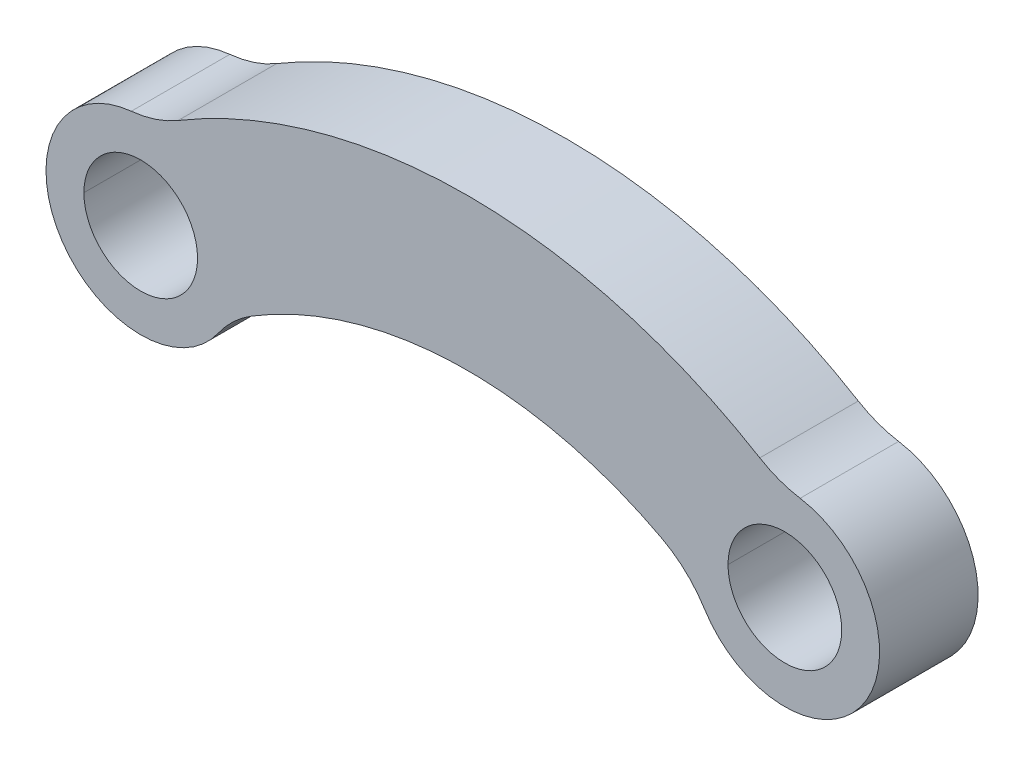
ISO-10303-21;
HEADER;
FILE_DESCRIPTION(('STEP AP214'),'2;1');
FILE_NAME('part.step','',(''),(''),'','','');
FILE_SCHEMA(('AUTOMOTIVE_DESIGN { 1 0 10303 214 1 1 1 1 }'));
ENDSEC;
DATA;
#1=APPLICATION_CONTEXT('core data for automotive mechanical design processes');
#2=APPLICATION_PROTOCOL_DEFINITION('international standard','automotive_design',2000,#1);
#3=PRODUCT_CONTEXT('',#1,'mechanical');
#4=PRODUCT('Part','Part','',(#3));
#5=PRODUCT_RELATED_PRODUCT_CATEGORY('part','',(#4));
#6=PRODUCT_DEFINITION_FORMATION('','',#4);
#7=PRODUCT_DEFINITION_CONTEXT('part definition',#1,'design');
#8=PRODUCT_DEFINITION('design','',#6,#7);
#9=PRODUCT_DEFINITION_SHAPE('','',#8);
#10=(LENGTH_UNIT() NAMED_UNIT(*) SI_UNIT(.MILLI.,.METRE.));
#11=(NAMED_UNIT(*) PLANE_ANGLE_UNIT() SI_UNIT($,.RADIAN.));
#12=(NAMED_UNIT(*) SI_UNIT($,.STERADIAN.) SOLID_ANGLE_UNIT());
#13=UNCERTAINTY_MEASURE_WITH_UNIT(LENGTH_MEASURE(1.E-05),#10,'distance_accuracy_value','');
#14=(GEOMETRIC_REPRESENTATION_CONTEXT(3) GLOBAL_UNCERTAINTY_ASSIGNED_CONTEXT((#13)) GLOBAL_UNIT_ASSIGNED_CONTEXT((#10,
#11,#12)) REPRESENTATION_CONTEXT('',''));
#15=CARTESIAN_POINT('',(0.,0.,0.));
#16=DIRECTION('',(0.,0.,1.));
#17=DIRECTION('',(1.,0.,0.));
#18=AXIS2_PLACEMENT_3D('',#15,#16,#17);
#19=CARTESIAN_POINT('',(0.,0.,-13.));
#20=DIRECTION('',(0.,0.,1.));
#21=DIRECTION('',(1.,0.,0.));
#22=AXIS2_PLACEMENT_3D('',#19,#20,#21);
#23=PLANE('',#22);
#24=CARTESIAN_POINT('',(86.3266611163251,-99.2991061715,-13.));
#25=DIRECTION('',(0.,0.,-1.));
#26=DIRECTION('',(-0.520907645721918,0.853613041505605,0.));
#27=AXIS2_PLACEMENT_3D('',#24,#25,#26);
#28=CIRCLE('',#27,109.307157311891);
#29=CARTESIAN_POINT('',(29.3877271404329,-5.9930911601655,-13.));
#30=VERTEX_POINT('',#29);
#31=CARTESIAN_POINT('',(137.394238755021,-2.65461769066565,-13.));
#32=VERTEX_POINT('',#31);
#33=EDGE_CURVE('E27',#30,#32,#28,.T.);
#34=ORIENTED_EDGE('',*,*,#33,.F.);
#35=CARTESIAN_POINT('',(45.0149565120903,-31.6014824053336,-13.));
#36=DIRECTION('',(0.,0.,-1.));
#37=DIRECTION('',(-0.81845375476528,0.574572407369703,0.));
#38=AXIS2_PLACEMENT_3D('',#35,#36,#37);
#39=CIRCLE('',#38,30.);
#40=CARTESIAN_POINT('',(20.461343869132,-14.3643101842425,-13.));
#41=VERTEX_POINT('',#40);
#42=EDGE_CURVE('E36',#41,#30,#39,.T.);
#43=ORIENTED_EDGE('',*,*,#42,.F.);
#44=CARTESIAN_POINT('',(0.,0.,-13.));
#45=DIRECTION('',(0.,0.,1.));
#46=DIRECTION('',(-0.0994891707491444,0.995038644929757,0.));
#47=AXIS2_PLACEMENT_3D('',#44,#45,#46);
#48=CIRCLE('',#47,25.);
#49=CARTESIAN_POINT('',(-2.4872292687286,24.8759661232439,-13.));
#50=VERTEX_POINT('',#49);
#51=EDGE_CURVE('E154',#50,#41,#48,.T.);
#52=ORIENTED_EDGE('',*,*,#51,.F.);
#53=CARTESIAN_POINT('',(-5.47190439120294,54.7271254711368,-13.));
#54=DIRECTION('',(0.,0.,-1.));
#55=DIRECTION('',(0.511962639326505,-0.859007715875614,0.));
#56=AXIS2_PLACEMENT_3D('',#53,#54,#55);
#57=CIRCLE('',#56,30.);
#58=CARTESIAN_POINT('',(9.88697478859226,28.9568939948682,-13.));
#59=VERTEX_POINT('',#58);
#60=EDGE_CURVE('E186',#59,#50,#57,.T.);
#61=ORIENTED_EDGE('',*,*,#60,.F.);
#62=CARTESIAN_POINT('',(86.3266611163252,-99.2991061715001,-13.));
#63=DIRECTION('',(0.,0.,1.));
#64=DIRECTION('',(0.516125846572471,0.856512761434323,0.));
#65=AXIS2_PLACEMENT_3D('',#62,#63,#64);
#66=CIRCLE('',#65,149.307157311891);
#67=CARTESIAN_POINT('',(163.387944083254,28.5843794396164,-13.));
#68=VERTEX_POINT('',#67);
#69=EDGE_CURVE('E83',#68,#59,#66,.T.);
#70=ORIENTED_EDGE('',*,*,#69,.F.);
#71=CARTESIAN_POINT('',(178.871719480427,54.2797622826452,-13.));
#72=DIRECTION('',(0.,0.,-1.));
#73=DIRECTION('',(-0.161303990553216,-0.986904768775391,0.));
#74=AXIS2_PLACEMENT_3D('',#71,#72,#73);
#75=CIRCLE('',#74,29.9999999999987);
#76=CARTESIAN_POINT('',(174.032599763831,24.6726192193847,-13.));
#77=VERTEX_POINT('',#76);
#78=EDGE_CURVE('E91',#77,#68,#75,.T.);
#79=ORIENTED_EDGE('',*,*,#78,.F.);
#80=CARTESIAN_POINT('',(170.,0.,-13.));
#81=DIRECTION('',(0.,0.,1.));
#82=DIRECTION('',(-0.847664762169217,-0.530532233682936,0.));
#83=AXIS2_PLACEMENT_3D('',#80,#81,#82);
#84=CIRCLE('',#83,25.);
#85=CARTESIAN_POINT('',(148.80838094577,-13.2633058420734,-13.));
#86=VERTEX_POINT('',#85);
#87=EDGE_CURVE('E20',#86,#77,#84,.T.);
#88=ORIENTED_EDGE('',*,*,#87,.F.);
#89=CARTESIAN_POINT('',(123.378438080693,-29.1792728525615,-13.));
#90=DIRECTION('',(0.,0.,-1.));
#91=DIRECTION('',(0.467193355810937,0.884155172063205,0.));
#92=AXIS2_PLACEMENT_3D('',#89,#90,#91);
#93=CIRCLE('',#92,29.9999999999997);
#94=EDGE_CURVE('E190',#32,#86,#93,.T.);
#95=ORIENTED_EDGE('',*,*,#94,.F.);
#96=EDGE_LOOP('',(#34,#43,#52,#61,#70,#79,#88,#95));
#97=FACE_BOUND('',#96,.T.);
#98=CARTESIAN_POINT('',(170.,0.,-13.));
#99=DIRECTION('',(0.,0.,-1.));
#100=DIRECTION('',(-1.,0.,0.));
#101=AXIS2_PLACEMENT_3D('',#98,#99,#100);
#102=CIRCLE('',#101,15.);
#103=CARTESIAN_POINT('',(155.,0.,-13.));
#104=VERTEX_POINT('',#103);
#105=CARTESIAN_POINT('',(185.,0.,-13.));
#106=VERTEX_POINT('',#105);
#107=EDGE_CURVE('E164',#104,#106,#102,.T.);
#108=ORIENTED_EDGE('',*,*,#107,.F.);
#109=CARTESIAN_POINT('',(170.,0.,-13.));
#110=DIRECTION('',(0.,0.,-1.));
#111=DIRECTION('',(1.,0.,0.));
#112=AXIS2_PLACEMENT_3D('',#109,#110,#111);
#113=CIRCLE('',#112,15.);
#114=EDGE_CURVE('E165',#106,#104,#113,.T.);
#115=ORIENTED_EDGE('',*,*,#114,.F.);
#116=EDGE_LOOP('',(#108,#115));
#117=FACE_BOUND('',#116,.T.);
#118=CARTESIAN_POINT('',(0.,0.,-13.));
#119=DIRECTION('',(0.,0.,-1.));
#120=DIRECTION('',(-1.,0.,0.));
#121=AXIS2_PLACEMENT_3D('',#118,#119,#120);
#122=CIRCLE('',#121,15.);
#123=CARTESIAN_POINT('',(-15.,0.,-13.));
#124=VERTEX_POINT('',#123);
#125=CARTESIAN_POINT('',(15.,0.,-13.));
#126=VERTEX_POINT('',#125);
#127=EDGE_CURVE('E171',#124,#126,#122,.T.);
#128=ORIENTED_EDGE('',*,*,#127,.F.);
#129=CARTESIAN_POINT('',(0.,0.,-13.));
#130=DIRECTION('',(0.,0.,-1.));
#131=DIRECTION('',(1.,0.,0.));
#132=AXIS2_PLACEMENT_3D('',#129,#130,#131);
#133=CIRCLE('',#132,15.);
#134=EDGE_CURVE('E138',#126,#124,#133,.T.);
#135=ORIENTED_EDGE('',*,*,#134,.F.);
#136=EDGE_LOOP('',(#128,#135));
#137=FACE_BOUND('',#136,.T.);
#138=ADVANCED_FACE('F16',(#97,#117,#137),#23,.F.);
#139=CARTESIAN_POINT('',(86.3266611163251,-99.2991061715001,-13.));
#140=DIRECTION('',(0.,0.,-1.));
#141=DIRECTION('',(1.,0.,0.));
#142=AXIS2_PLACEMENT_3D('',#139,#140,#141);
#143=CYLINDRICAL_SURFACE('',#142,109.307157311891);
#144=DIRECTION('',(0.,0.,1.));
#145=VECTOR('',#144,1.);
#146=CARTESIAN_POINT('',(137.394238755021,-2.65461769066559,-13.));
#147=LINE('',#146,#145);
#148=CARTESIAN_POINT('',(137.394238755021,-2.65461769066565,13.));
#149=VERTEX_POINT('',#148);
#150=EDGE_CURVE('E11',#32,#149,#147,.T.);
#151=ORIENTED_EDGE('',*,*,#150,.T.);
#152=CARTESIAN_POINT('',(86.3266611163251,-99.2991061715,13.));
#153=DIRECTION('',(0.,0.,-1.));
#154=DIRECTION('',(-0.520907645721918,0.853613041505605,0.));
#155=AXIS2_PLACEMENT_3D('',#152,#153,#154);
#156=CIRCLE('',#155,109.307157311891);
#157=CARTESIAN_POINT('',(29.3877271404329,-5.9930911601655,13.));
#158=VERTEX_POINT('',#157);
#159=EDGE_CURVE('E226',#158,#149,#156,.T.);
#160=ORIENTED_EDGE('',*,*,#159,.F.);
#161=DIRECTION('',(0.,0.,1.));
#162=VECTOR('',#161,1.);
#163=CARTESIAN_POINT('',(29.3877271404329,-5.99309116016551,-13.));
#164=LINE('',#163,#162);
#165=EDGE_CURVE('E198',#30,#158,#164,.T.);
#166=ORIENTED_EDGE('',*,*,#165,.F.);
#167=ORIENTED_EDGE('',*,*,#33,.T.);
#168=EDGE_LOOP('',(#151,#160,#166,#167));
#169=FACE_BOUND('',#168,.T.);
#170=ADVANCED_FACE('F18',(#169),#143,.F.);
#171=CARTESIAN_POINT('',(45.0149565120904,-31.6014824053336,-13.));
#172=DIRECTION('',(0.,0.,-1.));
#173=DIRECTION('',(1.,0.,0.));
#174=AXIS2_PLACEMENT_3D('',#171,#172,#173);
#175=CYLINDRICAL_SURFACE('',#174,30.);
#176=ORIENTED_EDGE('',*,*,#165,.T.);
#177=CARTESIAN_POINT('',(45.0149565120903,-31.6014824053336,13.));
#178=DIRECTION('',(0.,0.,-1.));
#179=DIRECTION('',(-0.81845375476528,0.574572407369703,0.));
#180=AXIS2_PLACEMENT_3D('',#177,#178,#179);
#181=CIRCLE('',#180,30.);
#182=CARTESIAN_POINT('',(20.461343869132,-14.3643101842425,13.));
#183=VERTEX_POINT('',#182);
#184=EDGE_CURVE('E182',#183,#158,#181,.T.);
#185=ORIENTED_EDGE('',*,*,#184,.F.);
#186=DIRECTION('',(0.,0.,1.));
#187=VECTOR('',#186,1.);
#188=CARTESIAN_POINT('',(20.461343869132,-14.3643101842425,-13.));
#189=LINE('',#188,#187);
#190=EDGE_CURVE('E151',#41,#183,#189,.T.);
#191=ORIENTED_EDGE('',*,*,#190,.F.);
#192=ORIENTED_EDGE('',*,*,#42,.T.);
#193=EDGE_LOOP('',(#176,#185,#191,#192));
#194=FACE_BOUND('',#193,.T.);
#195=ADVANCED_FACE('F249',(#194),#175,.F.);
#196=CARTESIAN_POINT('',(0.,0.,-13.));
#197=DIRECTION('',(0.,0.,-1.));
#198=DIRECTION('',(1.,0.,0.));
#199=AXIS2_PLACEMENT_3D('',#196,#197,#198);
#200=CYLINDRICAL_SURFACE('',#199,25.);
#201=ORIENTED_EDGE('',*,*,#190,.T.);
#202=CARTESIAN_POINT('',(0.,0.,13.));
#203=DIRECTION('',(0.,0.,1.));
#204=DIRECTION('',(-0.0994891707491444,0.995038644929757,0.));
#205=AXIS2_PLACEMENT_3D('',#202,#203,#204);
#206=CIRCLE('',#205,25.);
#207=CARTESIAN_POINT('',(-2.4872292687286,24.8759661232439,13.));
#208=VERTEX_POINT('',#207);
#209=EDGE_CURVE('E178',#208,#183,#206,.T.);
#210=ORIENTED_EDGE('',*,*,#209,.F.);
#211=DIRECTION('',(0.,0.,1.));
#212=VECTOR('',#211,1.);
#213=CARTESIAN_POINT('',(-2.48722926872859,24.8759661232439,-13.));
#214=LINE('',#213,#212);
#215=EDGE_CURVE('E202',#50,#208,#214,.T.);
#216=ORIENTED_EDGE('',*,*,#215,.F.);
#217=ORIENTED_EDGE('',*,*,#51,.T.);
#218=EDGE_LOOP('',(#201,#210,#216,#217));
#219=FACE_BOUND('',#218,.T.);
#220=ADVANCED_FACE('F247',(#219),#200,.T.);
#221=CARTESIAN_POINT('',(-5.47190439120291,54.7271254711367,-13.));
#222=DIRECTION('',(0.,0.,-1.));
#223=DIRECTION('',(1.,0.,0.));
#224=AXIS2_PLACEMENT_3D('',#221,#222,#223);
#225=CYLINDRICAL_SURFACE('',#224,30.);
#226=ORIENTED_EDGE('',*,*,#215,.T.);
#227=CARTESIAN_POINT('',(-5.47190439120294,54.7271254711368,13.));
#228=DIRECTION('',(0.,0.,-1.));
#229=DIRECTION('',(0.511962639326505,-0.859007715875614,0.));
#230=AXIS2_PLACEMENT_3D('',#227,#228,#229);
#231=CIRCLE('',#230,30.);
#232=CARTESIAN_POINT('',(9.88697478859226,28.9568939948682,13.));
#233=VERTEX_POINT('',#232);
#234=EDGE_CURVE('E157',#233,#208,#231,.T.);
#235=ORIENTED_EDGE('',*,*,#234,.F.);
#236=DIRECTION('',(0.,0.,1.));
#237=VECTOR('',#236,1.);
#238=CARTESIAN_POINT('',(9.88697478859219,28.9568939948682,-13.));
#239=LINE('',#238,#237);
#240=EDGE_CURVE('E183',#59,#233,#239,.T.);
#241=ORIENTED_EDGE('',*,*,#240,.F.);
#242=ORIENTED_EDGE('',*,*,#60,.T.);
#243=EDGE_LOOP('',(#226,#235,#241,#242));
#244=FACE_BOUND('',#243,.T.);
#245=ADVANCED_FACE('F240',(#244),#225,.F.);
#246=CARTESIAN_POINT('',(86.3266611163251,-99.2991061715001,-13.));
#247=DIRECTION('',(0.,0.,-1.));
#248=DIRECTION('',(1.,0.,0.));
#249=AXIS2_PLACEMENT_3D('',#246,#247,#248);
#250=CYLINDRICAL_SURFACE('',#249,149.307157311891);
#251=ORIENTED_EDGE('',*,*,#240,.T.);
#252=CARTESIAN_POINT('',(86.3266611163252,-99.2991061715001,13.));
#253=DIRECTION('',(0.,0.,1.));
#254=DIRECTION('',(0.516125846572471,0.856512761434323,0.));
#255=AXIS2_PLACEMENT_3D('',#252,#253,#254);
#256=CIRCLE('',#255,149.307157311891);
#257=CARTESIAN_POINT('',(163.387944083254,28.5843794396164,13.));
#258=VERTEX_POINT('',#257);
#259=EDGE_CURVE('E123',#258,#233,#256,.T.);
#260=ORIENTED_EDGE('',*,*,#259,.F.);
#261=DIRECTION('',(0.,0.,1.));
#262=VECTOR('',#261,1.);
#263=CARTESIAN_POINT('',(163.387944083254,28.5843794396166,-13.));
#264=LINE('',#263,#262);
#265=EDGE_CURVE('E117',#68,#258,#264,.T.);
#266=ORIENTED_EDGE('',*,*,#265,.F.);
#267=ORIENTED_EDGE('',*,*,#69,.T.);
#268=EDGE_LOOP('',(#251,#260,#266,#267));
#269=FACE_BOUND('',#268,.T.);
#270=ADVANCED_FACE('F348',(#269),#250,.T.);
#271=CARTESIAN_POINT('',(178.871719480427,54.2797622826464,-13.));
#272=DIRECTION('',(0.,0.,-1.));
#273=DIRECTION('',(1.,0.,0.));
#274=AXIS2_PLACEMENT_3D('',#271,#272,#273);
#275=CYLINDRICAL_SURFACE('',#274,30.);
#276=ORIENTED_EDGE('',*,*,#265,.T.);
#277=CARTESIAN_POINT('',(178.871719480427,54.2797622826452,13.));
#278=DIRECTION('',(0.,0.,-1.));
#279=DIRECTION('',(-0.161303990553216,-0.986904768775391,0.));
#280=AXIS2_PLACEMENT_3D('',#277,#278,#279);
#281=CIRCLE('',#280,29.9999999999987);
#282=CARTESIAN_POINT('',(174.032599763831,24.6726192193847,13.));
#283=VERTEX_POINT('',#282);
#284=EDGE_CURVE('E113',#283,#258,#281,.T.);
#285=ORIENTED_EDGE('',*,*,#284,.F.);
#286=DIRECTION('',(0.,0.,1.));
#287=VECTOR('',#286,1.);
#288=CARTESIAN_POINT('',(174.032599763831,24.6726192193847,-13.));
#289=LINE('',#288,#287);
#290=EDGE_CURVE('E116',#77,#283,#289,.T.);
#291=ORIENTED_EDGE('',*,*,#290,.F.);
#292=ORIENTED_EDGE('',*,*,#78,.T.);
#293=EDGE_LOOP('',(#276,#285,#291,#292));
#294=FACE_BOUND('',#293,.T.);
#295=ADVANCED_FACE('F115',(#294),#275,.F.);
#296=CARTESIAN_POINT('',(170.,0.,-13.));
#297=DIRECTION('',(0.,0.,-1.));
#298=DIRECTION('',(1.,0.,0.));
#299=AXIS2_PLACEMENT_3D('',#296,#297,#298);
#300=CYLINDRICAL_SURFACE('',#299,25.);
#301=ORIENTED_EDGE('',*,*,#290,.T.);
#302=CARTESIAN_POINT('',(170.,0.,13.));
#303=DIRECTION('',(0.,0.,1.));
#304=DIRECTION('',(-0.847664762169217,-0.530532233682936,0.));
#305=AXIS2_PLACEMENT_3D('',#302,#303,#304);
#306=CIRCLE('',#305,25.);
#307=CARTESIAN_POINT('',(148.80838094577,-13.2633058420734,13.));
#308=VERTEX_POINT('',#307);
#309=EDGE_CURVE('E122',#308,#283,#306,.T.);
#310=ORIENTED_EDGE('',*,*,#309,.F.);
#311=DIRECTION('',(0.,0.,1.));
#312=VECTOR('',#311,1.);
#313=CARTESIAN_POINT('',(148.80838094577,-13.2633058420735,-13.));
#314=LINE('',#313,#312);
#315=EDGE_CURVE('E193',#86,#308,#314,.T.);
#316=ORIENTED_EDGE('',*,*,#315,.F.);
#317=ORIENTED_EDGE('',*,*,#87,.T.);
#318=EDGE_LOOP('',(#301,#310,#316,#317));
#319=FACE_BOUND('',#318,.T.);
#320=ADVANCED_FACE('F126',(#319),#300,.T.);
#321=CARTESIAN_POINT('',(123.378438080693,-29.1792728525617,-13.));
#322=DIRECTION('',(0.,0.,-1.));
#323=DIRECTION('',(1.,0.,0.));
#324=AXIS2_PLACEMENT_3D('',#321,#322,#323);
#325=CYLINDRICAL_SURFACE('',#324,30.);
#326=ORIENTED_EDGE('',*,*,#315,.T.);
#327=CARTESIAN_POINT('',(123.378438080693,-29.1792728525615,13.));
#328=DIRECTION('',(0.,0.,-1.));
#329=DIRECTION('',(0.467193355810937,0.884155172063205,0.));
#330=AXIS2_PLACEMENT_3D('',#327,#328,#329);
#331=CIRCLE('',#330,29.9999999999997);
#332=EDGE_CURVE('E136',#149,#308,#331,.T.);
#333=ORIENTED_EDGE('',*,*,#332,.F.);
#334=ORIENTED_EDGE('',*,*,#150,.F.);
#335=ORIENTED_EDGE('',*,*,#94,.T.);
#336=EDGE_LOOP('',(#326,#333,#334,#335));
#337=FACE_BOUND('',#336,.T.);
#338=ADVANCED_FACE('F288',(#337),#325,.F.);
#339=CARTESIAN_POINT('',(170.,0.,-13.));
#340=DIRECTION('',(0.,0.,-1.));
#341=DIRECTION('',(1.,0.,0.));
#342=AXIS2_PLACEMENT_3D('',#339,#340,#341);
#343=CYLINDRICAL_SURFACE('',#342,15.);
#344=DIRECTION('',(0.,0.,1.));
#345=VECTOR('',#344,1.);
#346=CARTESIAN_POINT('',(185.,0.,-13.));
#347=LINE('',#346,#345);
#348=CARTESIAN_POINT('',(185.,0.,13.));
#349=VERTEX_POINT('',#348);
#350=EDGE_CURVE('E194',#106,#349,#347,.T.);
#351=ORIENTED_EDGE('',*,*,#350,.T.);
#352=CARTESIAN_POINT('',(170.,0.,13.));
#353=DIRECTION('',(0.,0.,-1.));
#354=DIRECTION('',(-1.,0.,0.));
#355=AXIS2_PLACEMENT_3D('',#352,#353,#354);
#356=CIRCLE('',#355,15.);
#357=CARTESIAN_POINT('',(155.,0.,13.));
#358=VERTEX_POINT('',#357);
#359=EDGE_CURVE('E219',#358,#349,#356,.T.);
#360=ORIENTED_EDGE('',*,*,#359,.F.);
#361=DIRECTION('',(0.,0.,1.));
#362=VECTOR('',#361,1.);
#363=CARTESIAN_POINT('',(155.,0.,-13.));
#364=LINE('',#363,#362);
#365=EDGE_CURVE('E160',#104,#358,#364,.T.);
#366=ORIENTED_EDGE('',*,*,#365,.F.);
#367=ORIENTED_EDGE('',*,*,#107,.T.);
#368=EDGE_LOOP('',(#351,#360,#366,#367));
#369=FACE_BOUND('',#368,.T.);
#370=ADVANCED_FACE('F267',(#369),#343,.F.);
#371=CARTESIAN_POINT('',(170.,0.,-13.));
#372=DIRECTION('',(0.,0.,-1.));
#373=DIRECTION('',(1.,0.,0.));
#374=AXIS2_PLACEMENT_3D('',#371,#372,#373);
#375=CYLINDRICAL_SURFACE('',#374,15.);
#376=ORIENTED_EDGE('',*,*,#365,.T.);
#377=CARTESIAN_POINT('',(170.,0.,13.));
#378=DIRECTION('',(0.,0.,-1.));
#379=DIRECTION('',(1.,0.,0.));
#380=AXIS2_PLACEMENT_3D('',#377,#378,#379);
#381=CIRCLE('',#380,15.);
#382=EDGE_CURVE('E222',#349,#358,#381,.T.);
#383=ORIENTED_EDGE('',*,*,#382,.F.);
#384=ORIENTED_EDGE('',*,*,#350,.F.);
#385=ORIENTED_EDGE('',*,*,#114,.T.);
#386=EDGE_LOOP('',(#376,#383,#384,#385));
#387=FACE_BOUND('',#386,.T.);
#388=ADVANCED_FACE('F263',(#387),#375,.F.);
#389=CARTESIAN_POINT('',(0.,0.,-13.));
#390=DIRECTION('',(0.,0.,-1.));
#391=DIRECTION('',(1.,0.,0.));
#392=AXIS2_PLACEMENT_3D('',#389,#390,#391);
#393=CYLINDRICAL_SURFACE('',#392,15.);
#394=DIRECTION('',(0.,0.,1.));
#395=VECTOR('',#394,1.);
#396=CARTESIAN_POINT('',(15.,0.,-13.));
#397=LINE('',#396,#395);
#398=CARTESIAN_POINT('',(15.,0.,13.));
#399=VERTEX_POINT('',#398);
#400=EDGE_CURVE('E168',#126,#399,#397,.T.);
#401=ORIENTED_EDGE('',*,*,#400,.T.);
#402=CARTESIAN_POINT('',(0.,0.,13.));
#403=DIRECTION('',(0.,0.,-1.));
#404=DIRECTION('',(-1.,0.,0.));
#405=AXIS2_PLACEMENT_3D('',#402,#403,#404);
#406=CIRCLE('',#405,15.);
#407=CARTESIAN_POINT('',(-15.,0.,13.));
#408=VERTEX_POINT('',#407);
#409=EDGE_CURVE('E177',#408,#399,#406,.T.);
#410=ORIENTED_EDGE('',*,*,#409,.F.);
#411=DIRECTION('',(0.,0.,1.));
#412=VECTOR('',#411,1.);
#413=CARTESIAN_POINT('',(-15.,0.,-13.));
#414=LINE('',#413,#412);
#415=EDGE_CURVE('E146',#124,#408,#414,.T.);
#416=ORIENTED_EDGE('',*,*,#415,.F.);
#417=ORIENTED_EDGE('',*,*,#127,.T.);
#418=EDGE_LOOP('',(#401,#410,#416,#417));
#419=FACE_BOUND('',#418,.T.);
#420=ADVANCED_FACE('F275',(#419),#393,.F.);
#421=CARTESIAN_POINT('',(0.,0.,-13.));
#422=DIRECTION('',(0.,0.,-1.));
#423=DIRECTION('',(1.,0.,0.));
#424=AXIS2_PLACEMENT_3D('',#421,#422,#423);
#425=CYLINDRICAL_SURFACE('',#424,15.);
#426=ORIENTED_EDGE('',*,*,#415,.T.);
#427=CARTESIAN_POINT('',(0.,0.,13.));
#428=DIRECTION('',(0.,0.,-1.));
#429=DIRECTION('',(1.,0.,0.));
#430=AXIS2_PLACEMENT_3D('',#427,#428,#429);
#431=CIRCLE('',#430,15.);
#432=EDGE_CURVE('E173',#399,#408,#431,.T.);
#433=ORIENTED_EDGE('',*,*,#432,.F.);
#434=ORIENTED_EDGE('',*,*,#400,.F.);
#435=ORIENTED_EDGE('',*,*,#134,.T.);
#436=EDGE_LOOP('',(#426,#433,#434,#435));
#437=FACE_BOUND('',#436,.T.);
#438=ADVANCED_FACE('F278',(#437),#425,.F.);
#439=CARTESIAN_POINT('',(0.,0.,13.));
#440=DIRECTION('',(0.,0.,1.));
#441=DIRECTION('',(1.,0.,0.));
#442=AXIS2_PLACEMENT_3D('',#439,#440,#441);
#443=PLANE('',#442);
#444=ORIENTED_EDGE('',*,*,#309,.T.);
#445=ORIENTED_EDGE('',*,*,#284,.T.);
#446=ORIENTED_EDGE('',*,*,#259,.T.);
#447=ORIENTED_EDGE('',*,*,#234,.T.);
#448=ORIENTED_EDGE('',*,*,#209,.T.);
#449=ORIENTED_EDGE('',*,*,#184,.T.);
#450=ORIENTED_EDGE('',*,*,#159,.T.);
#451=ORIENTED_EDGE('',*,*,#332,.T.);
#452=EDGE_LOOP('',(#444,#445,#446,#447,#448,#449,#450,#451));
#453=FACE_BOUND('',#452,.T.);
#454=ORIENTED_EDGE('',*,*,#359,.T.);
#455=ORIENTED_EDGE('',*,*,#382,.T.);
#456=EDGE_LOOP('',(#454,#455));
#457=FACE_BOUND('',#456,.T.);
#458=ORIENTED_EDGE('',*,*,#409,.T.);
#459=ORIENTED_EDGE('',*,*,#432,.T.);
#460=EDGE_LOOP('',(#458,#459));
#461=FACE_BOUND('',#460,.T.);
#462=ADVANCED_FACE('F133',(#453,#457,#461),#443,.T.);
#463=CLOSED_SHELL('',(#138,#170,#195,#220,#245,#270,#295,#320,#338,#370,#388,#420,#438,#462));
#464=MANIFOLD_SOLID_BREP('B1',#463);
#465=ADVANCED_BREP_SHAPE_REPRESENTATION('',(#18,#464),#14);
#466=SHAPE_DEFINITION_REPRESENTATION(#9,#465);
ENDSEC;
END-ISO-10303-21;
